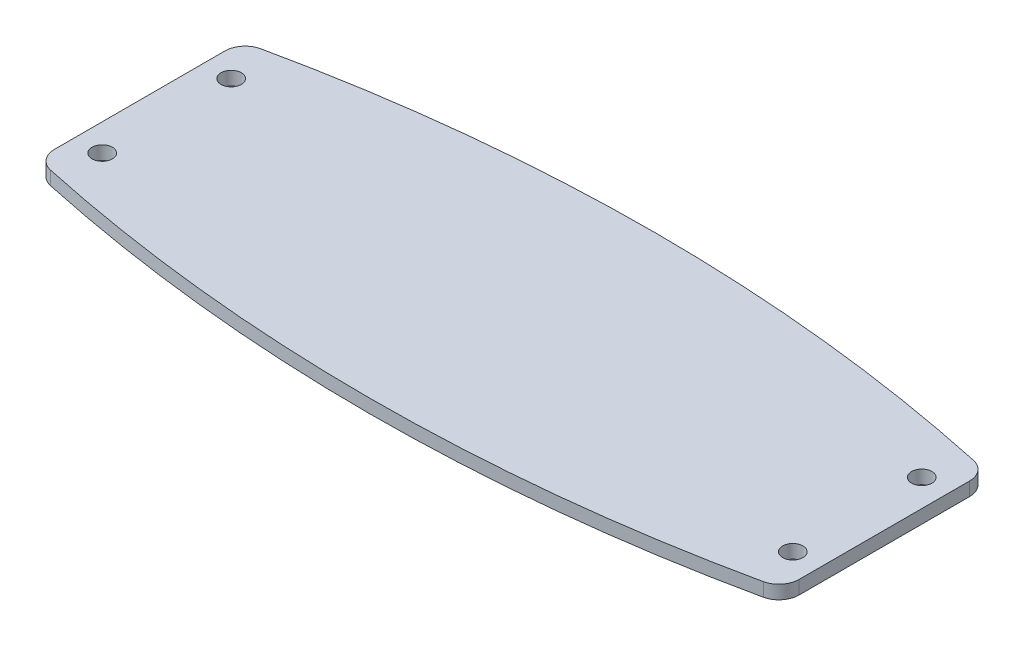
ISO-10303-21;
HEADER;
FILE_DESCRIPTION(('STEP AP214'),'2;1');
FILE_NAME('part.step','',(''),(''),'','','');
FILE_SCHEMA(('AUTOMOTIVE_DESIGN { 1 0 10303 214 1 1 1 1 }'));
ENDSEC;
DATA;
#1=APPLICATION_CONTEXT('core data for automotive mechanical design processes');
#2=APPLICATION_PROTOCOL_DEFINITION('international standard','automotive_design',2000,#1);
#3=PRODUCT_CONTEXT('',#1,'mechanical');
#4=PRODUCT('Part','Part','',(#3));
#5=PRODUCT_RELATED_PRODUCT_CATEGORY('part','',(#4));
#6=PRODUCT_DEFINITION_FORMATION('','',#4);
#7=PRODUCT_DEFINITION_CONTEXT('part definition',#1,'design');
#8=PRODUCT_DEFINITION('design','',#6,#7);
#9=PRODUCT_DEFINITION_SHAPE('','',#8);
#10=(LENGTH_UNIT() NAMED_UNIT(*) SI_UNIT(.MILLI.,.METRE.));
#11=(NAMED_UNIT(*) PLANE_ANGLE_UNIT() SI_UNIT($,.RADIAN.));
#12=(NAMED_UNIT(*) SI_UNIT($,.STERADIAN.) SOLID_ANGLE_UNIT());
#13=UNCERTAINTY_MEASURE_WITH_UNIT(LENGTH_MEASURE(1.E-05),#10,'distance_accuracy_value','');
#14=(GEOMETRIC_REPRESENTATION_CONTEXT(3) GLOBAL_UNCERTAINTY_ASSIGNED_CONTEXT((#13)) GLOBAL_UNIT_ASSIGNED_CONTEXT((#10,
#11,#12)) REPRESENTATION_CONTEXT('',''));
#15=CARTESIAN_POINT('',(0.,0.,0.));
#16=DIRECTION('',(0.,0.,1.));
#17=DIRECTION('',(1.,0.,0.));
#18=AXIS2_PLACEMENT_3D('',#15,#16,#17);
#19=CARTESIAN_POINT('',(52.,2.,27.5893151079433));
#20=DIRECTION('',(0.,-1.,0.));
#21=DIRECTION('',(0.,0.,-1.));
#22=AXIS2_PLACEMENT_3D('',#19,#20,#21);
#23=PLANE('',#22);
#24=CARTESIAN_POINT('',(52.,2.,27.5893151079433));
#25=DIRECTION('',(0.,1.,0.));
#26=DIRECTION('',(0.,0.,-1.));
#27=AXIS2_PLACEMENT_3D('',#24,#25,#26);
#28=CIRCLE('',#27,2.99999999999999);
#29=CARTESIAN_POINT('',(52.6315789473684,2.,30.5220796796812));
#30=VERTEX_POINT('',#29);
#31=CARTESIAN_POINT('',(55.,2.,27.5893151079433));
#32=VERTEX_POINT('',#31);
#33=EDGE_CURVE('E147',#30,#32,#28,.T.);
#34=ORIENTED_EDGE('',*,*,#33,.T.);
#35=DIRECTION('',(0.,0.,-1.));
#36=VECTOR('',#35,1.);
#37=CARTESIAN_POINT('',(55.,2.,2.4106848920567));
#38=LINE('',#37,#36);
#39=CARTESIAN_POINT('',(55.,2.,2.4106848920567));
#40=VERTEX_POINT('',#39);
#41=EDGE_CURVE('E95',#32,#40,#38,.T.);
#42=ORIENTED_EDGE('',*,*,#41,.T.);
#43=CARTESIAN_POINT('',(52.,2.,2.41068489205669));
#44=DIRECTION('',(0.,1.,0.));
#45=DIRECTION('',(0.,0.,-1.));
#46=AXIS2_PLACEMENT_3D('',#43,#44,#45);
#47=CIRCLE('',#46,2.99999999999998);
#48=CARTESIAN_POINT('',(52.6315789473684,2.,-0.522079679681184));
#49=VERTEX_POINT('',#48);
#50=EDGE_CURVE('E162',#40,#49,#47,.T.);
#51=ORIENTED_EDGE('',*,*,#50,.T.);
#52=CARTESIAN_POINT('',(0.,2.,243.874967965144));
#53=DIRECTION('',(0.,1.,0.));
#54=DIRECTION('',(0.,0.,-1.));
#55=AXIS2_PLACEMENT_3D('',#52,#53,#54);
#56=CIRCLE('',#55,250.);
#57=CARTESIAN_POINT('',(-52.6315789473686,2.,-0.522079679681126));
#58=VERTEX_POINT('',#57);
#59=EDGE_CURVE('E175',#49,#58,#56,.T.);
#60=ORIENTED_EDGE('',*,*,#59,.T.);
#61=CARTESIAN_POINT('',(-52.,2.,2.41068489205668));
#62=DIRECTION('',(0.,1.,0.));
#63=DIRECTION('',(0.,0.,1.));
#64=AXIS2_PLACEMENT_3D('',#61,#62,#63);
#65=CIRCLE('',#64,2.99999999999996);
#66=CARTESIAN_POINT('',(-55.,2.,2.41068489205668));
#67=VERTEX_POINT('',#66);
#68=EDGE_CURVE('E114',#58,#67,#65,.T.);
#69=ORIENTED_EDGE('',*,*,#68,.T.);
#70=DIRECTION('',(0.,0.,1.));
#71=VECTOR('',#70,1.);
#72=CARTESIAN_POINT('',(-55.,2.,2.41068489205668));
#73=LINE('',#72,#71);
#74=CARTESIAN_POINT('',(-55.,2.,27.5893151079433));
#75=VERTEX_POINT('',#74);
#76=EDGE_CURVE('E108',#67,#75,#73,.T.);
#77=ORIENTED_EDGE('',*,*,#76,.T.);
#78=CARTESIAN_POINT('',(-52.,2.,27.5893151079433));
#79=DIRECTION('',(0.,1.,0.));
#80=DIRECTION('',(0.,0.,1.));
#81=AXIS2_PLACEMENT_3D('',#78,#79,#80);
#82=CIRCLE('',#81,2.99999999999998);
#83=CARTESIAN_POINT('',(-52.6315789473684,2.,30.5220796796812));
#84=VERTEX_POINT('',#83);
#85=EDGE_CURVE('E112',#75,#84,#82,.T.);
#86=ORIENTED_EDGE('',*,*,#85,.T.);
#87=CARTESIAN_POINT('',(0.,2.,-213.874967965144));
#88=DIRECTION('',(0.,1.,0.));
#89=DIRECTION('',(0.,0.,1.));
#90=AXIS2_PLACEMENT_3D('',#87,#88,#89);
#91=CIRCLE('',#90,250.);
#92=EDGE_CURVE('E52',#84,#30,#91,.T.);
#93=ORIENTED_EDGE('',*,*,#92,.T.);
#94=EDGE_LOOP('',(#34,#42,#51,#60,#69,#77,#86,#93));
#95=FACE_BOUND('',#94,.T.);
#96=CARTESIAN_POINT('',(-51.,2.,24.5220796796812));
#97=DIRECTION('',(0.,1.,0.));
#98=DIRECTION('',(0.,0.,-1.));
#99=AXIS2_PLACEMENT_3D('',#96,#97,#98);
#100=CIRCLE('',#99,1.5);
#101=CARTESIAN_POINT('',(-51.,2.,23.0220796796811));
#102=VERTEX_POINT('',#101);
#103=EDGE_CURVE('E136',#102,#102,#100,.T.);
#104=ORIENTED_EDGE('',*,*,#103,.F.);
#105=EDGE_LOOP('',(#104));
#106=FACE_BOUND('',#105,.T.);
#107=CARTESIAN_POINT('',(-51.,2.,5.47792032031886));
#108=DIRECTION('',(0.,1.,0.));
#109=DIRECTION('',(0.,0.,1.));
#110=AXIS2_PLACEMENT_3D('',#107,#108,#109);
#111=CIRCLE('',#110,1.5);
#112=CARTESIAN_POINT('',(-51.,2.,6.97792032031887));
#113=VERTEX_POINT('',#112);
#114=EDGE_CURVE('E184',#113,#113,#111,.T.);
#115=ORIENTED_EDGE('',*,*,#114,.F.);
#116=EDGE_LOOP('',(#115));
#117=FACE_BOUND('',#116,.T.);
#118=CARTESIAN_POINT('',(51.,2.,5.47792032031885));
#119=DIRECTION('',(0.,1.,0.));
#120=DIRECTION('',(0.,0.,-1.));
#121=AXIS2_PLACEMENT_3D('',#118,#119,#120);
#122=CIRCLE('',#121,1.5);
#123=CARTESIAN_POINT('',(51.,2.,3.97792032031885));
#124=VERTEX_POINT('',#123);
#125=EDGE_CURVE('E190',#124,#124,#122,.T.);
#126=ORIENTED_EDGE('',*,*,#125,.F.);
#127=EDGE_LOOP('',(#126));
#128=FACE_BOUND('',#127,.T.);
#129=CARTESIAN_POINT('',(51.,2.,24.5220796796811));
#130=DIRECTION('',(0.,1.,0.));
#131=DIRECTION('',(0.,0.,1.));
#132=AXIS2_PLACEMENT_3D('',#129,#130,#131);
#133=CIRCLE('',#132,1.5);
#134=CARTESIAN_POINT('',(51.,2.,26.0220796796811));
#135=VERTEX_POINT('',#134);
#136=EDGE_CURVE('E196',#135,#135,#133,.T.);
#137=ORIENTED_EDGE('',*,*,#136,.F.);
#138=EDGE_LOOP('',(#137));
#139=FACE_BOUND('',#138,.T.);
#140=ADVANCED_FACE('F35',(#95,#106,#117,#128,#139),#23,.F.);
#141=CARTESIAN_POINT('',(52.,0.,27.5893151079433));
#142=DIRECTION('',(0.,-1.,0.));
#143=DIRECTION('',(0.,0.,-1.));
#144=AXIS2_PLACEMENT_3D('',#141,#142,#143);
#145=PLANE('',#144);
#146=CARTESIAN_POINT('',(51.,0.,5.47792032031885));
#147=DIRECTION('',(0.,1.,0.));
#148=DIRECTION('',(0.,0.,-1.));
#149=AXIS2_PLACEMENT_3D('',#146,#147,#148);
#150=CIRCLE('',#149,1.5);
#151=CARTESIAN_POINT('',(51.,0.,3.97792032031885));
#152=VERTEX_POINT('',#151);
#153=EDGE_CURVE('E193',#152,#152,#150,.T.);
#154=ORIENTED_EDGE('',*,*,#153,.T.);
#155=EDGE_LOOP('',(#154));
#156=FACE_BOUND('',#155,.T.);
#157=CARTESIAN_POINT('',(-51.,0.,24.5220796796812));
#158=DIRECTION('',(0.,1.,0.));
#159=DIRECTION('',(0.,0.,-1.));
#160=AXIS2_PLACEMENT_3D('',#157,#158,#159);
#161=CIRCLE('',#160,1.5);
#162=CARTESIAN_POINT('',(-51.,0.,23.0220796796811));
#163=VERTEX_POINT('',#162);
#164=EDGE_CURVE('E181',#163,#163,#161,.T.);
#165=ORIENTED_EDGE('',*,*,#164,.T.);
#166=EDGE_LOOP('',(#165));
#167=FACE_BOUND('',#166,.T.);
#168=CARTESIAN_POINT('',(52.,0.,27.5893151079433));
#169=DIRECTION('',(0.,1.,0.));
#170=DIRECTION('',(0.,0.,-1.));
#171=AXIS2_PLACEMENT_3D('',#168,#169,#170);
#172=CIRCLE('',#171,2.99999999999999);
#173=CARTESIAN_POINT('',(52.6315789473684,0.,30.5220796796812));
#174=VERTEX_POINT('',#173);
#175=CARTESIAN_POINT('',(55.,0.,27.5893151079433));
#176=VERTEX_POINT('',#175);
#177=EDGE_CURVE('E132',#174,#176,#172,.T.);
#178=ORIENTED_EDGE('',*,*,#177,.F.);
#179=CARTESIAN_POINT('',(0.,0.,-213.874967965144));
#180=DIRECTION('',(0.,1.,0.));
#181=DIRECTION('',(0.,0.,1.));
#182=AXIS2_PLACEMENT_3D('',#179,#180,#181);
#183=CIRCLE('',#182,250.);
#184=CARTESIAN_POINT('',(-52.6315789473684,0.,30.5220796796812));
#185=VERTEX_POINT('',#184);
#186=EDGE_CURVE('E87',#185,#174,#183,.T.);
#187=ORIENTED_EDGE('',*,*,#186,.F.);
#188=CARTESIAN_POINT('',(-52.,0.,27.5893151079433));
#189=DIRECTION('',(0.,1.,0.));
#190=DIRECTION('',(0.,0.,1.));
#191=AXIS2_PLACEMENT_3D('',#188,#189,#190);
#192=CIRCLE('',#191,2.99999999999998);
#193=CARTESIAN_POINT('',(-55.,0.,27.5893151079433));
#194=VERTEX_POINT('',#193);
#195=EDGE_CURVE('E81',#194,#185,#192,.T.);
#196=ORIENTED_EDGE('',*,*,#195,.F.);
#197=DIRECTION('',(0.,0.,1.));
#198=VECTOR('',#197,1.);
#199=CARTESIAN_POINT('',(-55.,0.,2.41068489205668));
#200=LINE('',#199,#198);
#201=CARTESIAN_POINT('',(-55.,0.,2.41068489205668));
#202=VERTEX_POINT('',#201);
#203=EDGE_CURVE('E122',#202,#194,#200,.T.);
#204=ORIENTED_EDGE('',*,*,#203,.F.);
#205=CARTESIAN_POINT('',(-52.,0.,2.41068489205668));
#206=DIRECTION('',(0.,1.,0.));
#207=DIRECTION('',(0.,0.,1.));
#208=AXIS2_PLACEMENT_3D('',#205,#206,#207);
#209=CIRCLE('',#208,2.99999999999996);
#210=CARTESIAN_POINT('',(-52.6315789473686,0.,-0.522079679681126));
#211=VERTEX_POINT('',#210);
#212=EDGE_CURVE('E142',#211,#202,#209,.T.);
#213=ORIENTED_EDGE('',*,*,#212,.F.);
#214=CARTESIAN_POINT('',(0.,0.,243.874967965144));
#215=DIRECTION('',(0.,1.,0.));
#216=DIRECTION('',(0.,0.,-1.));
#217=AXIS2_PLACEMENT_3D('',#214,#215,#216);
#218=CIRCLE('',#217,250.);
#219=CARTESIAN_POINT('',(52.6315789473684,0.,-0.522079679681184));
#220=VERTEX_POINT('',#219);
#221=EDGE_CURVE('E140',#220,#211,#218,.T.);
#222=ORIENTED_EDGE('',*,*,#221,.F.);
#223=CARTESIAN_POINT('',(52.,0.,2.41068489205669));
#224=DIRECTION('',(0.,1.,0.));
#225=DIRECTION('',(0.,0.,-1.));
#226=AXIS2_PLACEMENT_3D('',#223,#224,#225);
#227=CIRCLE('',#226,2.99999999999998);
#228=CARTESIAN_POINT('',(55.,0.,2.4106848920567));
#229=VERTEX_POINT('',#228);
#230=EDGE_CURVE('E138',#229,#220,#227,.T.);
#231=ORIENTED_EDGE('',*,*,#230,.F.);
#232=DIRECTION('',(0.,0.,-1.));
#233=VECTOR('',#232,1.);
#234=CARTESIAN_POINT('',(55.,0.,2.4106848920567));
#235=LINE('',#234,#233);
#236=EDGE_CURVE('E135',#176,#229,#235,.T.);
#237=ORIENTED_EDGE('',*,*,#236,.F.);
#238=EDGE_LOOP('',(#178,#187,#196,#204,#213,#222,#231,#237));
#239=FACE_BOUND('',#238,.T.);
#240=CARTESIAN_POINT('',(-51.,0.,5.47792032031886));
#241=DIRECTION('',(0.,1.,0.));
#242=DIRECTION('',(0.,0.,1.));
#243=AXIS2_PLACEMENT_3D('',#240,#241,#242);
#244=CIRCLE('',#243,1.5);
#245=CARTESIAN_POINT('',(-51.,0.,6.97792032031887));
#246=VERTEX_POINT('',#245);
#247=EDGE_CURVE('E187',#246,#246,#244,.T.);
#248=ORIENTED_EDGE('',*,*,#247,.T.);
#249=EDGE_LOOP('',(#248));
#250=FACE_BOUND('',#249,.T.);
#251=CARTESIAN_POINT('',(51.,0.,24.5220796796811));
#252=DIRECTION('',(0.,1.,0.));
#253=DIRECTION('',(0.,0.,1.));
#254=AXIS2_PLACEMENT_3D('',#251,#252,#253);
#255=CIRCLE('',#254,1.5);
#256=CARTESIAN_POINT('',(51.,0.,26.0220796796811));
#257=VERTEX_POINT('',#256);
#258=EDGE_CURVE('E199',#257,#257,#255,.T.);
#259=ORIENTED_EDGE('',*,*,#258,.T.);
#260=EDGE_LOOP('',(#259));
#261=FACE_BOUND('',#260,.T.);
#262=ADVANCED_FACE('F166',(#156,#167,#239,#250,#261),#145,.T.);
#263=CARTESIAN_POINT('',(52.,2.,27.5893151079433));
#264=DIRECTION('',(0.,-1.,0.));
#265=DIRECTION('',(0.,0.,-1.));
#266=AXIS2_PLACEMENT_3D('',#263,#264,#265);
#267=CYLINDRICAL_SURFACE('',#266,2.99999999999999);
#268=ORIENTED_EDGE('',*,*,#177,.T.);
#269=DIRECTION('',(0.,-1.,0.));
#270=VECTOR('',#269,1.);
#271=CARTESIAN_POINT('',(55.,2.,27.5893151079433));
#272=LINE('',#271,#270);
#273=EDGE_CURVE('E11',#32,#176,#272,.T.);
#274=ORIENTED_EDGE('',*,*,#273,.F.);
#275=ORIENTED_EDGE('',*,*,#33,.F.);
#276=DIRECTION('',(0.,-1.,0.));
#277=VECTOR('',#276,1.);
#278=CARTESIAN_POINT('',(52.6315789473684,2.,30.5220796796812));
#279=LINE('',#278,#277);
#280=EDGE_CURVE('E128',#30,#174,#279,.T.);
#281=ORIENTED_EDGE('',*,*,#280,.T.);
#282=EDGE_LOOP('',(#268,#274,#275,#281));
#283=FACE_BOUND('',#282,.T.);
#284=ADVANCED_FACE('F37',(#283),#267,.T.);
#285=CARTESIAN_POINT('',(55.,2.,2.4106848920567));
#286=DIRECTION('',(-1.,0.,0.));
#287=DIRECTION('',(0.,0.,1.));
#288=AXIS2_PLACEMENT_3D('',#285,#286,#287);
#289=PLANE('',#288);
#290=ORIENTED_EDGE('',*,*,#236,.T.);
#291=DIRECTION('',(0.,-1.,0.));
#292=VECTOR('',#291,1.);
#293=CARTESIAN_POINT('',(55.,2.,2.4106848920567));
#294=LINE('',#293,#292);
#295=EDGE_CURVE('E44',#40,#229,#294,.T.);
#296=ORIENTED_EDGE('',*,*,#295,.F.);
#297=ORIENTED_EDGE('',*,*,#41,.F.);
#298=ORIENTED_EDGE('',*,*,#273,.T.);
#299=EDGE_LOOP('',(#290,#296,#297,#298));
#300=FACE_BOUND('',#299,.T.);
#301=ADVANCED_FACE('F231',(#300),#289,.F.);
#302=CARTESIAN_POINT('',(52.,2.,2.41068489205669));
#303=DIRECTION('',(0.,-1.,0.));
#304=DIRECTION('',(0.,0.,-1.));
#305=AXIS2_PLACEMENT_3D('',#302,#303,#304);
#306=CYLINDRICAL_SURFACE('',#305,2.99999999999998);
#307=ORIENTED_EDGE('',*,*,#230,.T.);
#308=DIRECTION('',(0.,-1.,0.));
#309=VECTOR('',#308,1.);
#310=CARTESIAN_POINT('',(52.6315789473684,2.,-0.522079679681184));
#311=LINE('',#310,#309);
#312=EDGE_CURVE('E154',#49,#220,#311,.T.);
#313=ORIENTED_EDGE('',*,*,#312,.F.);
#314=ORIENTED_EDGE('',*,*,#50,.F.);
#315=ORIENTED_EDGE('',*,*,#295,.T.);
#316=EDGE_LOOP('',(#307,#313,#314,#315));
#317=FACE_BOUND('',#316,.T.);
#318=ADVANCED_FACE('F160',(#317),#306,.T.);
#319=CARTESIAN_POINT('',(0.,2.,243.874967965144));
#320=DIRECTION('',(0.,-1.,0.));
#321=DIRECTION('',(0.,0.,-1.));
#322=AXIS2_PLACEMENT_3D('',#319,#320,#321);
#323=CYLINDRICAL_SURFACE('',#322,250.);
#324=ORIENTED_EDGE('',*,*,#221,.T.);
#325=DIRECTION('',(0.,-1.,0.));
#326=VECTOR('',#325,1.);
#327=CARTESIAN_POINT('',(-52.6315789473686,2.,-0.522079679681126));
#328=LINE('',#327,#326);
#329=EDGE_CURVE('E151',#58,#211,#328,.T.);
#330=ORIENTED_EDGE('',*,*,#329,.F.);
#331=ORIENTED_EDGE('',*,*,#59,.F.);
#332=ORIENTED_EDGE('',*,*,#312,.T.);
#333=EDGE_LOOP('',(#324,#330,#331,#332));
#334=FACE_BOUND('',#333,.T.);
#335=ADVANCED_FACE('F171',(#334),#323,.T.);
#336=CARTESIAN_POINT('',(-52.,2.,2.41068489205668));
#337=DIRECTION('',(0.,-1.,0.));
#338=DIRECTION('',(0.,0.,-1.));
#339=AXIS2_PLACEMENT_3D('',#336,#337,#338);
#340=CYLINDRICAL_SURFACE('',#339,2.99999999999996);
#341=ORIENTED_EDGE('',*,*,#212,.T.);
#342=DIRECTION('',(0.,-1.,0.));
#343=VECTOR('',#342,1.);
#344=CARTESIAN_POINT('',(-55.,2.,2.41068489205668));
#345=LINE('',#344,#343);
#346=EDGE_CURVE('E123',#67,#202,#345,.T.);
#347=ORIENTED_EDGE('',*,*,#346,.F.);
#348=ORIENTED_EDGE('',*,*,#68,.F.);
#349=ORIENTED_EDGE('',*,*,#329,.T.);
#350=EDGE_LOOP('',(#341,#347,#348,#349));
#351=FACE_BOUND('',#350,.T.);
#352=ADVANCED_FACE('F174',(#351),#340,.T.);
#353=CARTESIAN_POINT('',(-55.,2.,2.41068489205668));
#354=DIRECTION('',(1.,0.,0.));
#355=DIRECTION('',(0.,0.,-1.));
#356=AXIS2_PLACEMENT_3D('',#353,#354,#355);
#357=PLANE('',#356);
#358=ORIENTED_EDGE('',*,*,#203,.T.);
#359=DIRECTION('',(0.,-1.,0.));
#360=VECTOR('',#359,1.);
#361=CARTESIAN_POINT('',(-55.,2.,27.5893151079433));
#362=LINE('',#361,#360);
#363=EDGE_CURVE('E119',#75,#194,#362,.T.);
#364=ORIENTED_EDGE('',*,*,#363,.F.);
#365=ORIENTED_EDGE('',*,*,#76,.F.);
#366=ORIENTED_EDGE('',*,*,#346,.T.);
#367=EDGE_LOOP('',(#358,#364,#365,#366));
#368=FACE_BOUND('',#367,.T.);
#369=ADVANCED_FACE('F120',(#368),#357,.F.);
#370=CARTESIAN_POINT('',(-52.,2.,27.5893151079433));
#371=DIRECTION('',(0.,-1.,0.));
#372=DIRECTION('',(0.,0.,-1.));
#373=AXIS2_PLACEMENT_3D('',#370,#371,#372);
#374=CYLINDRICAL_SURFACE('',#373,2.99999999999998);
#375=ORIENTED_EDGE('',*,*,#195,.T.);
#376=DIRECTION('',(0.,-1.,0.));
#377=VECTOR('',#376,1.);
#378=CARTESIAN_POINT('',(-52.6315789473684,2.,30.5220796796812));
#379=LINE('',#378,#377);
#380=EDGE_CURVE('E124',#84,#185,#379,.T.);
#381=ORIENTED_EDGE('',*,*,#380,.F.);
#382=ORIENTED_EDGE('',*,*,#85,.F.);
#383=ORIENTED_EDGE('',*,*,#363,.T.);
#384=EDGE_LOOP('',(#375,#381,#382,#383));
#385=FACE_BOUND('',#384,.T.);
#386=ADVANCED_FACE('F126',(#385),#374,.T.);
#387=CARTESIAN_POINT('',(0.,2.,-213.874967965144));
#388=DIRECTION('',(0.,-1.,0.));
#389=DIRECTION('',(0.,0.,-1.));
#390=AXIS2_PLACEMENT_3D('',#387,#388,#389);
#391=CYLINDRICAL_SURFACE('',#390,250.);
#392=ORIENTED_EDGE('',*,*,#186,.T.);
#393=ORIENTED_EDGE('',*,*,#280,.F.);
#394=ORIENTED_EDGE('',*,*,#92,.F.);
#395=ORIENTED_EDGE('',*,*,#380,.T.);
#396=EDGE_LOOP('',(#392,#393,#394,#395));
#397=FACE_BOUND('',#396,.T.);
#398=ADVANCED_FACE('F219',(#397),#391,.T.);
#399=CARTESIAN_POINT('',(-51.,2.,24.5220796796812));
#400=DIRECTION('',(0.,-1.,0.));
#401=DIRECTION('',(0.,0.,-1.));
#402=AXIS2_PLACEMENT_3D('',#399,#400,#401);
#403=CYLINDRICAL_SURFACE('',#402,1.5);
#404=ORIENTED_EDGE('',*,*,#103,.T.);
#405=EDGE_LOOP('',(#404));
#406=FACE_BOUND('',#405,.T.);
#407=ORIENTED_EDGE('',*,*,#164,.F.);
#408=EDGE_LOOP('',(#407));
#409=FACE_BOUND('',#408,.T.);
#410=ADVANCED_FACE('F216',(#406,#409),#403,.F.);
#411=CARTESIAN_POINT('',(-51.,2.,5.47792032031886));
#412=DIRECTION('',(0.,-1.,0.));
#413=DIRECTION('',(0.,0.,-1.));
#414=AXIS2_PLACEMENT_3D('',#411,#412,#413);
#415=CYLINDRICAL_SURFACE('',#414,1.5);
#416=ORIENTED_EDGE('',*,*,#114,.T.);
#417=EDGE_LOOP('',(#416));
#418=FACE_BOUND('',#417,.T.);
#419=ORIENTED_EDGE('',*,*,#247,.F.);
#420=EDGE_LOOP('',(#419));
#421=FACE_BOUND('',#420,.T.);
#422=ADVANCED_FACE('F295',(#418,#421),#415,.F.);
#423=CARTESIAN_POINT('',(51.,2.,5.47792032031885));
#424=DIRECTION('',(0.,-1.,0.));
#425=DIRECTION('',(0.,0.,-1.));
#426=AXIS2_PLACEMENT_3D('',#423,#424,#425);
#427=CYLINDRICAL_SURFACE('',#426,1.5);
#428=ORIENTED_EDGE('',*,*,#125,.T.);
#429=EDGE_LOOP('',(#428));
#430=FACE_BOUND('',#429,.T.);
#431=ORIENTED_EDGE('',*,*,#153,.F.);
#432=EDGE_LOOP('',(#431));
#433=FACE_BOUND('',#432,.T.);
#434=ADVANCED_FACE('F303',(#430,#433),#427,.F.);
#435=CARTESIAN_POINT('',(51.,2.,24.5220796796811));
#436=DIRECTION('',(0.,-1.,0.));
#437=DIRECTION('',(0.,0.,-1.));
#438=AXIS2_PLACEMENT_3D('',#435,#436,#437);
#439=CYLINDRICAL_SURFACE('',#438,1.5);
#440=ORIENTED_EDGE('',*,*,#136,.T.);
#441=EDGE_LOOP('',(#440));
#442=FACE_BOUND('',#441,.T.);
#443=ORIENTED_EDGE('',*,*,#258,.F.);
#444=EDGE_LOOP('',(#443));
#445=FACE_BOUND('',#444,.T.);
#446=ADVANCED_FACE('F205',(#442,#445),#439,.F.);
#447=CLOSED_SHELL('',(#140,#262,#284,#301,#318,#335,#352,#369,#386,#398,#410,#422,#434,#446));
#448=MANIFOLD_SOLID_BREP('B2',#447);
#449=ADVANCED_BREP_SHAPE_REPRESENTATION('',(#18,#448),#14);
#450=SHAPE_DEFINITION_REPRESENTATION(#9,#449);
ENDSEC;
END-ISO-10303-21;
